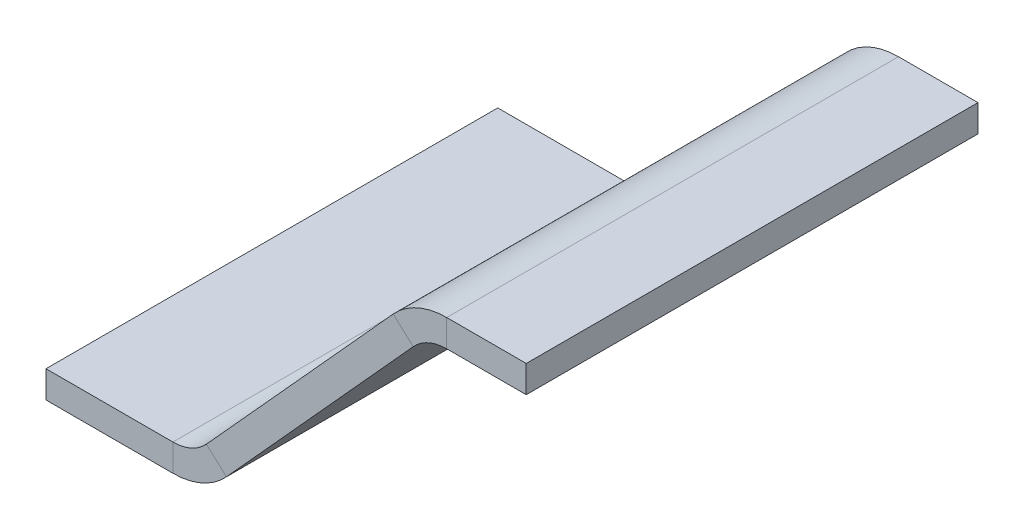
ISO-10303-21;
HEADER;
FILE_DESCRIPTION(('STEP AP214'),'2;1');
FILE_NAME('part.step','',(''),(''),'','','');
FILE_SCHEMA(('AUTOMOTIVE_DESIGN { 1 0 10303 214 1 1 1 1 }'));
ENDSEC;
DATA;
#1=APPLICATION_CONTEXT('core data for automotive mechanical design processes');
#2=APPLICATION_PROTOCOL_DEFINITION('international standard','automotive_design',2000,#1);
#3=PRODUCT_CONTEXT('',#1,'mechanical');
#4=PRODUCT('Part','Part','',(#3));
#5=PRODUCT_RELATED_PRODUCT_CATEGORY('part','',(#4));
#6=PRODUCT_DEFINITION_FORMATION('','',#4);
#7=PRODUCT_DEFINITION_CONTEXT('part definition',#1,'design');
#8=PRODUCT_DEFINITION('design','',#6,#7);
#9=PRODUCT_DEFINITION_SHAPE('','',#8);
#10=(LENGTH_UNIT() NAMED_UNIT(*) SI_UNIT(.MILLI.,.METRE.));
#11=(NAMED_UNIT(*) PLANE_ANGLE_UNIT() SI_UNIT($,.RADIAN.));
#12=(NAMED_UNIT(*) SI_UNIT($,.STERADIAN.) SOLID_ANGLE_UNIT());
#13=UNCERTAINTY_MEASURE_WITH_UNIT(LENGTH_MEASURE(1.E-05),#10,'distance_accuracy_value','');
#14=(GEOMETRIC_REPRESENTATION_CONTEXT(3) GLOBAL_UNCERTAINTY_ASSIGNED_CONTEXT((#13)) GLOBAL_UNIT_ASSIGNED_CONTEXT((#10,
#11,#12)) REPRESENTATION_CONTEXT('',''));
#15=CARTESIAN_POINT('',(0.,0.,0.));
#16=DIRECTION('',(0.,0.,1.));
#17=DIRECTION('',(1.,0.,0.));
#18=AXIS2_PLACEMENT_3D('',#15,#16,#17);
#19=CARTESIAN_POINT('',(16.2628457748691,1.5,0.));
#20=DIRECTION('',(0.,0.,1.));
#21=DIRECTION('',(-0.671519424738859,-0.740986951435983,0.));
#22=AXIS2_PLACEMENT_3D('',#19,#20,#21);
#23=PLANE('',#22);
#24=DIRECTION('',(-0.740986951435983,0.671519424738859,0.));
#25=VECTOR('',#24,1.);
#26=CARTESIAN_POINT('',(38.4266685882656,25.9566320699548,0.));
#27=LINE('',#26,#25);
#28=CARTESIAN_POINT('',(40.6496294425736,23.9420737957382,0.));
#29=VERTEX_POINT('',#28);
#30=CARTESIAN_POINT('',(38.4266685882656,25.9566320699548,0.));
#31=VERTEX_POINT('',#30);
#32=EDGE_CURVE('E11',#29,#31,#27,.T.);
#33=ORIENTED_EDGE('',*,*,#32,.F.);
#34=DIRECTION('',(0.671519424738859,0.740986951435983,0.));
#35=VECTOR('',#34,1.);
#36=CARTESIAN_POINT('',(18.4858066291771,-0.514558274216577,0.));
#37=LINE('',#36,#35);
#38=CARTESIAN_POINT('',(19.9742342358291,1.12784460208913,0.));
#39=VERTEX_POINT('',#38);
#40=EDGE_CURVE('E94',#29,#39,#37,.F.);
#41=ORIENTED_EDGE('',*,*,#40,.T.);
#42=DIRECTION('',(-0.740986951435983,0.671519424738859,0.));
#43=VECTOR('',#42,1.);
#44=CARTESIAN_POINT('',(17.7512733815211,3.14240287630571,0.));
#45=LINE('',#44,#43);
#46=CARTESIAN_POINT('',(17.7512733815211,3.14240287630571,0.));
#47=VERTEX_POINT('',#46);
#48=EDGE_CURVE('E47',#39,#47,#45,.T.);
#49=ORIENTED_EDGE('',*,*,#48,.T.);
#50=DIRECTION('',(-0.671519424738859,-0.740986951435983,0.));
#51=VECTOR('',#50,1.);
#52=CARTESIAN_POINT('',(16.2628457748691,1.5,0.));
#53=LINE('',#52,#51);
#54=EDGE_CURVE('E96',#31,#47,#53,.T.);
#55=ORIENTED_EDGE('',*,*,#54,.F.);
#56=EDGE_LOOP('',(#33,#41,#49,#55));
#57=FACE_BOUND('',#56,.T.);
#58=ADVANCED_FACE('F37',(#57),#23,.F.);
#59=CARTESIAN_POINT('',(14.0463386243412,6.5,0.));
#60=DIRECTION('',(0.,0.,-1.));
#61=DIRECTION('',(-1.,0.,0.));
#62=AXIS2_PLACEMENT_3D('',#59,#60,#61);
#63=PLANE('',#62);
#64=ORIENTED_EDGE('',*,*,#48,.F.);
#65=CARTESIAN_POINT('',(14.0463386243412,6.5,0.));
#66=DIRECTION('',(0.,0.,1.));
#67=DIRECTION('',(1.,0.,0.));
#68=AXIS2_PLACEMENT_3D('',#65,#66,#67);
#69=CIRCLE('',#68,8.);
#70=CARTESIAN_POINT('',(14.0463386243412,-1.5,0.));
#71=VERTEX_POINT('',#70);
#72=EDGE_CURVE('E135',#39,#71,#69,.F.);
#73=ORIENTED_EDGE('',*,*,#72,.T.);
#74=DIRECTION('',(0.,1.,0.));
#75=VECTOR('',#74,1.);
#76=CARTESIAN_POINT('',(14.0463386243412,1.5,0.));
#77=LINE('',#76,#75);
#78=CARTESIAN_POINT('',(14.0463386243412,1.5,0.));
#79=VERTEX_POINT('',#78);
#80=EDGE_CURVE('E162',#71,#79,#77,.T.);
#81=ORIENTED_EDGE('',*,*,#80,.T.);
#82=CARTESIAN_POINT('',(14.0463386243412,6.5,0.));
#83=DIRECTION('',(0.,0.,1.));
#84=DIRECTION('',(1.,0.,0.));
#85=AXIS2_PLACEMENT_3D('',#82,#83,#84);
#86=CIRCLE('',#85,5.);
#87=EDGE_CURVE('E171',#47,#79,#86,.F.);
#88=ORIENTED_EDGE('',*,*,#87,.F.);
#89=EDGE_LOOP('',(#64,#73,#81,#88));
#90=FACE_BOUND('',#89,.T.);
#91=ADVANCED_FACE('F170',(#90),#63,.T.);
#92=CARTESIAN_POINT('',(0.,1.5,0.));
#93=DIRECTION('',(0.,0.,1.));
#94=DIRECTION('',(-1.,0.,0.));
#95=AXIS2_PLACEMENT_3D('',#92,#93,#94);
#96=PLANE('',#95);
#97=ORIENTED_EDGE('',*,*,#80,.F.);
#98=DIRECTION('',(1.,0.,0.));
#99=VECTOR('',#98,1.);
#100=CARTESIAN_POINT('',(0.,-1.5,0.));
#101=LINE('',#100,#99);
#102=CARTESIAN_POINT('',(0.,-1.5,0.));
#103=VERTEX_POINT('',#102);
#104=EDGE_CURVE('E132',#71,#103,#101,.F.);
#105=ORIENTED_EDGE('',*,*,#104,.T.);
#106=DIRECTION('',(0.,1.,0.));
#107=VECTOR('',#106,1.);
#108=CARTESIAN_POINT('',(0.,1.5,0.));
#109=LINE('',#108,#107);
#110=CARTESIAN_POINT('',(0.,1.5,0.));
#111=VERTEX_POINT('',#110);
#112=EDGE_CURVE('E159',#103,#111,#109,.T.);
#113=ORIENTED_EDGE('',*,*,#112,.T.);
#114=DIRECTION('',(-1.,0.,0.));
#115=VECTOR('',#114,1.);
#116=CARTESIAN_POINT('',(0.,1.5,0.));
#117=LINE('',#116,#115);
#118=EDGE_CURVE('E190',#79,#111,#117,.T.);
#119=ORIENTED_EDGE('',*,*,#118,.F.);
#120=EDGE_LOOP('',(#97,#105,#113,#119));
#121=FACE_BOUND('',#120,.T.);
#122=ADVANCED_FACE('F191',(#121),#96,.F.);
#123=CARTESIAN_POINT('',(0.,1.5,50.));
#124=DIRECTION('',(-1.,0.,0.));
#125=DIRECTION('',(0.,0.,-1.));
#126=AXIS2_PLACEMENT_3D('',#123,#124,#125);
#127=PLANE('',#126);
#128=ORIENTED_EDGE('',*,*,#112,.F.);
#129=DIRECTION('',(0.,0.,-1.));
#130=VECTOR('',#129,1.);
#131=CARTESIAN_POINT('',(0.,-1.5,50.));
#132=LINE('',#131,#130);
#133=CARTESIAN_POINT('',(0.,-1.5,50.));
#134=VERTEX_POINT('',#133);
#135=EDGE_CURVE('E228',#134,#103,#132,.T.);
#136=ORIENTED_EDGE('',*,*,#135,.F.);
#137=DIRECTION('',(0.,1.,0.));
#138=VECTOR('',#137,1.);
#139=CARTESIAN_POINT('',(0.,1.5,50.));
#140=LINE('',#139,#138);
#141=CARTESIAN_POINT('',(0.,1.5,50.));
#142=VERTEX_POINT('',#141);
#143=EDGE_CURVE('E156',#134,#142,#140,.T.);
#144=ORIENTED_EDGE('',*,*,#143,.T.);
#145=DIRECTION('',(0.,0.,-1.));
#146=VECTOR('',#145,1.);
#147=CARTESIAN_POINT('',(0.,1.5,50.));
#148=LINE('',#147,#146);
#149=EDGE_CURVE('E195',#142,#111,#148,.T.);
#150=ORIENTED_EDGE('',*,*,#149,.T.);
#151=EDGE_LOOP('',(#128,#136,#144,#150));
#152=FACE_BOUND('',#151,.T.);
#153=ADVANCED_FACE('F239',(#152),#127,.T.);
#154=CARTESIAN_POINT('',(0.,1.5,50.));
#155=DIRECTION('',(0.,0.,1.));
#156=DIRECTION('',(-1.,0.,0.));
#157=AXIS2_PLACEMENT_3D('',#154,#155,#156);
#158=PLANE('',#157);
#159=ORIENTED_EDGE('',*,*,#143,.F.);
#160=DIRECTION('',(1.,0.,0.));
#161=VECTOR('',#160,1.);
#162=CARTESIAN_POINT('',(0.,-1.5,50.));
#163=LINE('',#162,#161);
#164=CARTESIAN_POINT('',(14.0463386243412,-1.5,50.));
#165=VERTEX_POINT('',#164);
#166=EDGE_CURVE('E125',#165,#134,#163,.F.);
#167=ORIENTED_EDGE('',*,*,#166,.F.);
#168=DIRECTION('',(0.,1.,0.));
#169=VECTOR('',#168,1.);
#170=CARTESIAN_POINT('',(14.0463386243412,1.5,50.));
#171=LINE('',#170,#169);
#172=CARTESIAN_POINT('',(14.0463386243412,1.5,50.));
#173=VERTEX_POINT('',#172);
#174=EDGE_CURVE('E153',#165,#173,#171,.T.);
#175=ORIENTED_EDGE('',*,*,#174,.T.);
#176=DIRECTION('',(-1.,0.,0.));
#177=VECTOR('',#176,1.);
#178=CARTESIAN_POINT('',(0.,1.5,50.));
#179=LINE('',#178,#177);
#180=EDGE_CURVE('E201',#173,#142,#179,.T.);
#181=ORIENTED_EDGE('',*,*,#180,.T.);
#182=EDGE_LOOP('',(#159,#167,#175,#181));
#183=FACE_BOUND('',#182,.T.);
#184=ADVANCED_FACE('F289',(#183),#158,.T.);
#185=CARTESIAN_POINT('',(14.0463386243412,6.5,50.));
#186=DIRECTION('',(0.,0.,1.));
#187=DIRECTION('',(1.,0.,0.));
#188=AXIS2_PLACEMENT_3D('',#185,#186,#187);
#189=PLANE('',#188);
#190=ORIENTED_EDGE('',*,*,#174,.F.);
#191=CARTESIAN_POINT('',(14.0463386243412,6.5,50.));
#192=DIRECTION('',(0.,0.,1.));
#193=DIRECTION('',(1.,0.,0.));
#194=AXIS2_PLACEMENT_3D('',#191,#192,#193);
#195=CIRCLE('',#194,8.);
#196=CARTESIAN_POINT('',(19.9742342358291,1.12784460208913,50.));
#197=VERTEX_POINT('',#196);
#198=EDGE_CURVE('E130',#165,#197,#195,.T.);
#199=ORIENTED_EDGE('',*,*,#198,.T.);
#200=DIRECTION('',(-0.740986951435983,0.671519424738859,0.));
#201=VECTOR('',#200,1.);
#202=CARTESIAN_POINT('',(17.7512733815211,3.14240287630571,50.));
#203=LINE('',#202,#201);
#204=CARTESIAN_POINT('',(17.7512733815211,3.14240287630571,50.));
#205=VERTEX_POINT('',#204);
#206=EDGE_CURVE('E151',#197,#205,#203,.T.);
#207=ORIENTED_EDGE('',*,*,#206,.T.);
#208=CARTESIAN_POINT('',(14.0463386243412,6.5,50.));
#209=DIRECTION('',(0.,0.,-1.));
#210=DIRECTION('',(-1.,0.,0.));
#211=AXIS2_PLACEMENT_3D('',#208,#209,#210);
#212=CIRCLE('',#211,5.);
#213=EDGE_CURVE('E187',#173,#205,#212,.F.);
#214=ORIENTED_EDGE('',*,*,#213,.F.);
#215=EDGE_LOOP('',(#190,#199,#207,#214));
#216=FACE_BOUND('',#215,.T.);
#217=ADVANCED_FACE('F291',(#216),#189,.T.);
#218=CARTESIAN_POINT('',(16.2628457748691,1.5,50.));
#219=DIRECTION('',(0.,0.,1.));
#220=DIRECTION('',(-0.671519424738859,-0.740986951435983,0.));
#221=AXIS2_PLACEMENT_3D('',#218,#219,#220);
#222=PLANE('',#221);
#223=ORIENTED_EDGE('',*,*,#206,.F.);
#224=DIRECTION('',(0.671519424738859,0.740986951435983,0.));
#225=VECTOR('',#224,1.);
#226=CARTESIAN_POINT('',(18.4858066291771,-0.514558274216577,50.));
#227=LINE('',#226,#225);
#228=CARTESIAN_POINT('',(40.6496294425736,23.9420737957382,50.));
#229=VERTEX_POINT('',#228);
#230=EDGE_CURVE('E124',#229,#197,#227,.F.);
#231=ORIENTED_EDGE('',*,*,#230,.F.);
#232=DIRECTION('',(-0.740986951435983,0.671519424738859,0.));
#233=VECTOR('',#232,1.);
#234=CARTESIAN_POINT('',(38.4266685882656,25.9566320699548,50.));
#235=LINE('',#234,#233);
#236=CARTESIAN_POINT('',(38.4266685882656,25.9566320699548,50.));
#237=VERTEX_POINT('',#236);
#238=EDGE_CURVE('E148',#229,#237,#235,.T.);
#239=ORIENTED_EDGE('',*,*,#238,.T.);
#240=DIRECTION('',(-0.671519424738859,-0.740986951435983,0.));
#241=VECTOR('',#240,1.);
#242=CARTESIAN_POINT('',(16.2628457748691,1.5,50.));
#243=LINE('',#242,#241);
#244=EDGE_CURVE('E246',#237,#205,#243,.T.);
#245=ORIENTED_EDGE('',*,*,#244,.T.);
#246=EDGE_LOOP('',(#223,#231,#239,#245));
#247=FACE_BOUND('',#246,.T.);
#248=ADVANCED_FACE('F294',(#247),#222,.T.);
#249=CARTESIAN_POINT('',(44.3545641997535,20.5844766720439,50.));
#250=DIRECTION('',(0.,0.,-1.));
#251=DIRECTION('',(-1.,0.,0.));
#252=AXIS2_PLACEMENT_3D('',#249,#250,#251);
#253=PLANE('',#252);
#254=ORIENTED_EDGE('',*,*,#238,.F.);
#255=CARTESIAN_POINT('',(44.3545641997535,20.5844766720439,50.));
#256=DIRECTION('',(0.,0.,-1.));
#257=DIRECTION('',(-1.,0.,0.));
#258=AXIS2_PLACEMENT_3D('',#255,#256,#257);
#259=CIRCLE('',#258,5.);
#260=CARTESIAN_POINT('',(44.3545641997535,25.5844766720439,50.));
#261=VERTEX_POINT('',#260);
#262=EDGE_CURVE('E112',#229,#261,#259,.T.);
#263=ORIENTED_EDGE('',*,*,#262,.T.);
#264=DIRECTION('',(0.,1.,0.));
#265=VECTOR('',#264,1.);
#266=CARTESIAN_POINT('',(44.3545641997535,28.5844766720439,50.));
#267=LINE('',#266,#265);
#268=CARTESIAN_POINT('',(44.3545641997535,28.5844766720439,50.));
#269=VERTEX_POINT('',#268);
#270=EDGE_CURVE('E145',#261,#269,#267,.T.);
#271=ORIENTED_EDGE('',*,*,#270,.T.);
#272=CARTESIAN_POINT('',(44.3545641997535,20.5844766720439,50.));
#273=DIRECTION('',(0.,0.,1.));
#274=DIRECTION('',(1.,0.,0.));
#275=AXIS2_PLACEMENT_3D('',#272,#273,#274);
#276=CIRCLE('',#275,8.);
#277=EDGE_CURVE('E196',#237,#269,#276,.F.);
#278=ORIENTED_EDGE('',*,*,#277,.F.);
#279=EDGE_LOOP('',(#254,#263,#271,#278));
#280=FACE_BOUND('',#279,.T.);
#281=ADVANCED_FACE('F321',(#280),#253,.F.);
#282=CARTESIAN_POINT('',(40.8081527589089,28.5844766720439,50.));
#283=DIRECTION('',(0.,0.,1.));
#284=DIRECTION('',(-1.,0.,0.));
#285=AXIS2_PLACEMENT_3D('',#282,#283,#284);
#286=PLANE('',#285);
#287=ORIENTED_EDGE('',*,*,#270,.F.);
#288=DIRECTION('',(1.,0.,0.));
#289=VECTOR('',#288,1.);
#290=CARTESIAN_POINT('',(40.8081527589089,25.5844766720439,50.));
#291=LINE('',#290,#289);
#292=CARTESIAN_POINT('',(53.1532854688862,25.5844766720439,50.));
#293=VERTEX_POINT('',#292);
#294=EDGE_CURVE('E220',#293,#261,#291,.F.);
#295=ORIENTED_EDGE('',*,*,#294,.F.);
#296=DIRECTION('',(0.,1.,0.));
#297=VECTOR('',#296,1.);
#298=CARTESIAN_POINT('',(53.1532854688862,28.5844766720439,50.));
#299=LINE('',#298,#297);
#300=CARTESIAN_POINT('',(53.1532854688862,28.5844766720439,50.));
#301=VERTEX_POINT('',#300);
#302=EDGE_CURVE('E142',#293,#301,#299,.T.);
#303=ORIENTED_EDGE('',*,*,#302,.T.);
#304=DIRECTION('',(-1.,0.,0.));
#305=VECTOR('',#304,1.);
#306=CARTESIAN_POINT('',(40.8081527589089,28.5844766720439,50.));
#307=LINE('',#306,#305);
#308=EDGE_CURVE('E252',#301,#269,#307,.T.);
#309=ORIENTED_EDGE('',*,*,#308,.T.);
#310=EDGE_LOOP('',(#287,#295,#303,#309));
#311=FACE_BOUND('',#310,.T.);
#312=ADVANCED_FACE('F270',(#311),#286,.T.);
#313=CARTESIAN_POINT('',(53.1532854688862,28.5844766720439,50.));
#314=DIRECTION('',(-1.,0.,0.));
#315=DIRECTION('',(0.,0.,-1.));
#316=AXIS2_PLACEMENT_3D('',#313,#314,#315);
#317=PLANE('',#316);
#318=ORIENTED_EDGE('',*,*,#302,.F.);
#319=DIRECTION('',(0.,0.,-1.));
#320=VECTOR('',#319,1.);
#321=CARTESIAN_POINT('',(53.1532854688862,25.5844766720439,50.));
#322=LINE('',#321,#320);
#323=CARTESIAN_POINT('',(53.1532854688862,25.5844766720439,0.));
#324=VERTEX_POINT('',#323);
#325=EDGE_CURVE('E117',#293,#324,#322,.T.);
#326=ORIENTED_EDGE('',*,*,#325,.T.);
#327=DIRECTION('',(0.,1.,0.));
#328=VECTOR('',#327,1.);
#329=CARTESIAN_POINT('',(53.1532854688862,28.5844766720439,0.));
#330=LINE('',#329,#328);
#331=CARTESIAN_POINT('',(53.1532854688862,28.5844766720439,0.));
#332=VERTEX_POINT('',#331);
#333=EDGE_CURVE('E139',#324,#332,#330,.T.);
#334=ORIENTED_EDGE('',*,*,#333,.T.);
#335=DIRECTION('',(0.,0.,-1.));
#336=VECTOR('',#335,1.);
#337=CARTESIAN_POINT('',(53.1532854688862,28.5844766720439,50.));
#338=LINE('',#337,#336);
#339=EDGE_CURVE('E255',#301,#332,#338,.T.);
#340=ORIENTED_EDGE('',*,*,#339,.F.);
#341=EDGE_LOOP('',(#318,#326,#334,#340));
#342=FACE_BOUND('',#341,.T.);
#343=ADVANCED_FACE('F326',(#342),#317,.F.);
#344=CARTESIAN_POINT('',(40.8081527589089,28.5844766720439,0.));
#345=DIRECTION('',(0.,0.,1.));
#346=DIRECTION('',(-1.,0.,0.));
#347=AXIS2_PLACEMENT_3D('',#344,#345,#346);
#348=PLANE('',#347);
#349=ORIENTED_EDGE('',*,*,#333,.F.);
#350=DIRECTION('',(1.,0.,0.));
#351=VECTOR('',#350,1.);
#352=CARTESIAN_POINT('',(40.8081527589089,25.5844766720439,0.));
#353=LINE('',#352,#351);
#354=CARTESIAN_POINT('',(44.3545641997535,25.5844766720439,0.));
#355=VERTEX_POINT('',#354);
#356=EDGE_CURVE('E218',#324,#355,#353,.F.);
#357=ORIENTED_EDGE('',*,*,#356,.T.);
#358=DIRECTION('',(0.,1.,0.));
#359=VECTOR('',#358,1.);
#360=CARTESIAN_POINT('',(44.3545641997535,28.5844766720439,0.));
#361=LINE('',#360,#359);
#362=CARTESIAN_POINT('',(44.3545641997535,28.5844766720439,0.));
#363=VERTEX_POINT('',#362);
#364=EDGE_CURVE('E41',#355,#363,#361,.T.);
#365=ORIENTED_EDGE('',*,*,#364,.T.);
#366=DIRECTION('',(-1.,0.,0.));
#367=VECTOR('',#366,1.);
#368=CARTESIAN_POINT('',(40.8081527589089,28.5844766720439,0.));
#369=LINE('',#368,#367);
#370=EDGE_CURVE('E249',#332,#363,#369,.T.);
#371=ORIENTED_EDGE('',*,*,#370,.F.);
#372=EDGE_LOOP('',(#349,#357,#365,#371));
#373=FACE_BOUND('',#372,.T.);
#374=ADVANCED_FACE('F280',(#373),#348,.F.);
#375=CARTESIAN_POINT('',(44.3545641997535,20.5844766720439,0.));
#376=DIRECTION('',(0.,0.,1.));
#377=DIRECTION('',(1.,0.,0.));
#378=AXIS2_PLACEMENT_3D('',#375,#376,#377);
#379=PLANE('',#378);
#380=CARTESIAN_POINT('',(44.3545641997535,20.5844766720439,0.));
#381=DIRECTION('',(0.,0.,-1.));
#382=DIRECTION('',(-1.,0.,0.));
#383=AXIS2_PLACEMENT_3D('',#380,#381,#382);
#384=CIRCLE('',#383,5.);
#385=EDGE_CURVE('E109',#355,#29,#384,.F.);
#386=ORIENTED_EDGE('',*,*,#385,.T.);
#387=ORIENTED_EDGE('',*,*,#32,.T.);
#388=CARTESIAN_POINT('',(44.3545641997535,20.5844766720439,0.));
#389=DIRECTION('',(0.,0.,-1.));
#390=DIRECTION('',(-1.,0.,0.));
#391=AXIS2_PLACEMENT_3D('',#388,#389,#390);
#392=CIRCLE('',#391,8.);
#393=EDGE_CURVE('E213',#363,#31,#392,.F.);
#394=ORIENTED_EDGE('',*,*,#393,.F.);
#395=ORIENTED_EDGE('',*,*,#364,.F.);
#396=EDGE_LOOP('',(#386,#387,#394,#395));
#397=FACE_BOUND('',#396,.T.);
#398=ADVANCED_FACE('F39',(#397),#379,.F.);
#399=CARTESIAN_POINT('',(40.8081527589089,28.5844766720439,50.));
#400=DIRECTION('',(0.,-1.,0.));
#401=DIRECTION('',(0.,0.,-1.));
#402=AXIS2_PLACEMENT_3D('',#399,#400,#401);
#403=PLANE('',#402);
#404=ORIENTED_EDGE('',*,*,#370,.T.);
#405=DIRECTION('',(0.,0.,-1.));
#406=VECTOR('',#405,1.);
#407=CARTESIAN_POINT('',(44.3545641997535,28.5844766720439,50.));
#408=LINE('',#407,#406);
#409=EDGE_CURVE('E203',#363,#269,#408,.F.);
#410=ORIENTED_EDGE('',*,*,#409,.T.);
#411=ORIENTED_EDGE('',*,*,#308,.F.);
#412=ORIENTED_EDGE('',*,*,#339,.T.);
#413=EDGE_LOOP('',(#404,#410,#411,#412));
#414=FACE_BOUND('',#413,.T.);
#415=ADVANCED_FACE('F275',(#414),#403,.F.);
#416=CARTESIAN_POINT('',(16.2628457748691,1.5,50.));
#417=DIRECTION('',(0.740986951435983,-0.671519424738859,0.));
#418=DIRECTION('',(0.671519424738859,0.740986951435983,0.));
#419=AXIS2_PLACEMENT_3D('',#416,#417,#418);
#420=PLANE('',#419);
#421=ORIENTED_EDGE('',*,*,#54,.T.);
#422=DIRECTION('',(0.,0.,-1.));
#423=VECTOR('',#422,1.);
#424=CARTESIAN_POINT('',(17.7512733815211,3.14240287630571,50.));
#425=LINE('',#424,#423);
#426=EDGE_CURVE('E186',#47,#205,#425,.F.);
#427=ORIENTED_EDGE('',*,*,#426,.T.);
#428=ORIENTED_EDGE('',*,*,#244,.F.);
#429=DIRECTION('',(0.,0.,-1.));
#430=VECTOR('',#429,1.);
#431=CARTESIAN_POINT('',(38.4266685882656,25.9566320699548,50.));
#432=LINE('',#431,#430);
#433=EDGE_CURVE('E207',#237,#31,#432,.T.);
#434=ORIENTED_EDGE('',*,*,#433,.T.);
#435=EDGE_LOOP('',(#421,#427,#428,#434));
#436=FACE_BOUND('',#435,.T.);
#437=ADVANCED_FACE('F296',(#436),#420,.F.);
#438=CARTESIAN_POINT('',(0.,1.5,50.));
#439=DIRECTION('',(0.,-1.,0.));
#440=DIRECTION('',(0.,0.,-1.));
#441=AXIS2_PLACEMENT_3D('',#438,#439,#440);
#442=PLANE('',#441);
#443=ORIENTED_EDGE('',*,*,#180,.F.);
#444=DIRECTION('',(0.,0.,-1.));
#445=VECTOR('',#444,1.);
#446=CARTESIAN_POINT('',(14.0463386243412,1.5,0.));
#447=LINE('',#446,#445);
#448=EDGE_CURVE('E184',#173,#79,#447,.T.);
#449=ORIENTED_EDGE('',*,*,#448,.T.);
#450=ORIENTED_EDGE('',*,*,#118,.T.);
#451=ORIENTED_EDGE('',*,*,#149,.F.);
#452=EDGE_LOOP('',(#443,#449,#450,#451));
#453=FACE_BOUND('',#452,.T.);
#454=ADVANCED_FACE('F199',(#453),#442,.F.);
#455=CARTESIAN_POINT('',(44.3545641997535,20.5844766720439,50.));
#456=DIRECTION('',(0.,0.,-1.));
#457=DIRECTION('',(-1.,0.,0.));
#458=AXIS2_PLACEMENT_3D('',#455,#456,#457);
#459=CYLINDRICAL_SURFACE('',#458,8.);
#460=ORIENTED_EDGE('',*,*,#277,.T.);
#461=ORIENTED_EDGE('',*,*,#409,.F.);
#462=ORIENTED_EDGE('',*,*,#393,.T.);
#463=ORIENTED_EDGE('',*,*,#433,.F.);
#464=EDGE_LOOP('',(#460,#461,#462,#463));
#465=FACE_BOUND('',#464,.T.);
#466=ADVANCED_FACE('F263',(#465),#459,.T.);
#467=CARTESIAN_POINT('',(14.0463386243412,6.5,50.));
#468=DIRECTION('',(0.,0.,1.));
#469=DIRECTION('',(1.,0.,0.));
#470=AXIS2_PLACEMENT_3D('',#467,#468,#469);
#471=CYLINDRICAL_SURFACE('',#470,5.);
#472=ORIENTED_EDGE('',*,*,#213,.T.);
#473=ORIENTED_EDGE('',*,*,#426,.F.);
#474=ORIENTED_EDGE('',*,*,#87,.T.);
#475=ORIENTED_EDGE('',*,*,#448,.F.);
#476=EDGE_LOOP('',(#472,#473,#474,#475));
#477=FACE_BOUND('',#476,.T.);
#478=ADVANCED_FACE('F182',(#477),#471,.F.);
#479=CARTESIAN_POINT('',(40.8081527589089,25.5844766720439,50.));
#480=DIRECTION('',(0.,-1.,0.));
#481=DIRECTION('',(0.,0.,-1.));
#482=AXIS2_PLACEMENT_3D('',#479,#480,#481);
#483=PLANE('',#482);
#484=ORIENTED_EDGE('',*,*,#356,.F.);
#485=ORIENTED_EDGE('',*,*,#325,.F.);
#486=ORIENTED_EDGE('',*,*,#294,.T.);
#487=DIRECTION('',(0.,0.,-1.));
#488=VECTOR('',#487,1.);
#489=CARTESIAN_POINT('',(44.3545641997535,25.5844766720439,50.));
#490=LINE('',#489,#488);
#491=EDGE_CURVE('E116',#355,#261,#490,.F.);
#492=ORIENTED_EDGE('',*,*,#491,.F.);
#493=EDGE_LOOP('',(#484,#485,#486,#492));
#494=FACE_BOUND('',#493,.T.);
#495=ADVANCED_FACE('F341',(#494),#483,.T.);
#496=CARTESIAN_POINT('',(18.4858066291771,-0.514558274216577,50.));
#497=DIRECTION('',(0.740986951435983,-0.671519424738859,0.));
#498=DIRECTION('',(0.671519424738859,0.740986951435983,0.));
#499=AXIS2_PLACEMENT_3D('',#496,#497,#498);
#500=PLANE('',#499);
#501=ORIENTED_EDGE('',*,*,#40,.F.);
#502=DIRECTION('',(0.,0.,1.));
#503=VECTOR('',#502,1.);
#504=CARTESIAN_POINT('',(40.6496294425736,23.9420737957382,50.));
#505=LINE('',#504,#503);
#506=EDGE_CURVE('E106',#229,#29,#505,.F.);
#507=ORIENTED_EDGE('',*,*,#506,.F.);
#508=ORIENTED_EDGE('',*,*,#230,.T.);
#509=DIRECTION('',(0.,0.,1.));
#510=VECTOR('',#509,1.);
#511=CARTESIAN_POINT('',(19.9742342358291,1.12784460208913,50.));
#512=LINE('',#511,#510);
#513=EDGE_CURVE('E122',#39,#197,#512,.T.);
#514=ORIENTED_EDGE('',*,*,#513,.F.);
#515=EDGE_LOOP('',(#501,#507,#508,#514));
#516=FACE_BOUND('',#515,.T.);
#517=ADVANCED_FACE('F120',(#516),#500,.T.);
#518=CARTESIAN_POINT('',(0.,-1.5,50.));
#519=DIRECTION('',(0.,-1.,0.));
#520=DIRECTION('',(0.,0.,-1.));
#521=AXIS2_PLACEMENT_3D('',#518,#519,#520);
#522=PLANE('',#521);
#523=ORIENTED_EDGE('',*,*,#166,.T.);
#524=ORIENTED_EDGE('',*,*,#135,.T.);
#525=ORIENTED_EDGE('',*,*,#104,.F.);
#526=DIRECTION('',(0.,0.,-1.));
#527=VECTOR('',#526,1.);
#528=CARTESIAN_POINT('',(14.0463386243412,-1.5,50.));
#529=LINE('',#528,#527);
#530=EDGE_CURVE('E214',#165,#71,#529,.T.);
#531=ORIENTED_EDGE('',*,*,#530,.F.);
#532=EDGE_LOOP('',(#523,#524,#525,#531));
#533=FACE_BOUND('',#532,.T.);
#534=ADVANCED_FACE('F234',(#533),#522,.T.);
#535=CARTESIAN_POINT('',(44.3545641997535,20.5844766720439,50.));
#536=DIRECTION('',(0.,0.,-1.));
#537=DIRECTION('',(-1.,0.,0.));
#538=AXIS2_PLACEMENT_3D('',#535,#536,#537);
#539=CYLINDRICAL_SURFACE('',#538,5.);
#540=ORIENTED_EDGE('',*,*,#262,.F.);
#541=ORIENTED_EDGE('',*,*,#506,.T.);
#542=ORIENTED_EDGE('',*,*,#385,.F.);
#543=ORIENTED_EDGE('',*,*,#491,.T.);
#544=EDGE_LOOP('',(#540,#541,#542,#543));
#545=FACE_BOUND('',#544,.T.);
#546=ADVANCED_FACE('F107',(#545),#539,.F.);
#547=CARTESIAN_POINT('',(14.0463386243412,6.5,50.));
#548=DIRECTION('',(0.,0.,1.));
#549=DIRECTION('',(1.,0.,0.));
#550=AXIS2_PLACEMENT_3D('',#547,#548,#549);
#551=CYLINDRICAL_SURFACE('',#550,8.);
#552=ORIENTED_EDGE('',*,*,#198,.F.);
#553=ORIENTED_EDGE('',*,*,#530,.T.);
#554=ORIENTED_EDGE('',*,*,#72,.F.);
#555=ORIENTED_EDGE('',*,*,#513,.T.);
#556=EDGE_LOOP('',(#552,#553,#554,#555));
#557=FACE_BOUND('',#556,.T.);
#558=ADVANCED_FACE('F331',(#557),#551,.T.);
#559=CLOSED_SHELL('',(#58,#91,#122,#153,#184,#217,#248,#281,#312,#343,#374,#398,#415,#437,#454,
#466,#478,#495,#517,#534,#546,#558));
#560=MANIFOLD_SOLID_BREP('B2',#559);
#561=ADVANCED_BREP_SHAPE_REPRESENTATION('',(#18,#560),#14);
#562=SHAPE_DEFINITION_REPRESENTATION(#9,#561);
ENDSEC;
END-ISO-10303-21;
